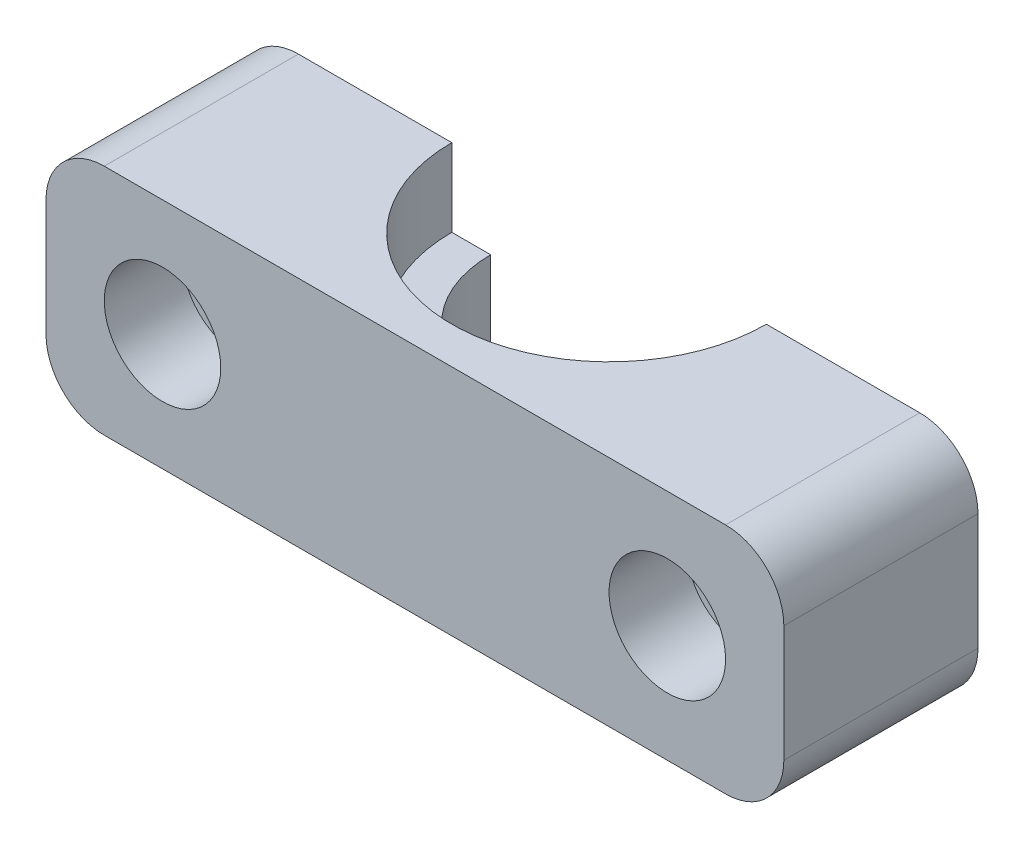
ISO-10303-21;
HEADER;
FILE_DESCRIPTION(('STEP AP214'),'2;1');
FILE_NAME('part.step','',(''),(''),'','','');
FILE_SCHEMA(('AUTOMOTIVE_DESIGN { 1 0 10303 214 1 1 1 1 }'));
ENDSEC;
DATA;
#1=APPLICATION_CONTEXT('core data for automotive mechanical design processes');
#2=APPLICATION_PROTOCOL_DEFINITION('international standard','automotive_design',2000,#1);
#3=PRODUCT_CONTEXT('',#1,'mechanical');
#4=PRODUCT('Part','Part','',(#3));
#5=PRODUCT_RELATED_PRODUCT_CATEGORY('part','',(#4));
#6=PRODUCT_DEFINITION_FORMATION('','',#4);
#7=PRODUCT_DEFINITION_CONTEXT('part definition',#1,'design');
#8=PRODUCT_DEFINITION('design','',#6,#7);
#9=PRODUCT_DEFINITION_SHAPE('','',#8);
#10=(LENGTH_UNIT() NAMED_UNIT(*) SI_UNIT(.MILLI.,.METRE.));
#11=(NAMED_UNIT(*) PLANE_ANGLE_UNIT() SI_UNIT($,.RADIAN.));
#12=(NAMED_UNIT(*) SI_UNIT($,.STERADIAN.) SOLID_ANGLE_UNIT());
#13=UNCERTAINTY_MEASURE_WITH_UNIT(LENGTH_MEASURE(1.E-05),#10,'distance_accuracy_value','');
#14=(GEOMETRIC_REPRESENTATION_CONTEXT(3) GLOBAL_UNCERTAINTY_ASSIGNED_CONTEXT((#13)) GLOBAL_UNIT_ASSIGNED_CONTEXT((#10,
#11,#12)) REPRESENTATION_CONTEXT('',''));
#15=CARTESIAN_POINT('',(0.,0.,0.));
#16=DIRECTION('',(0.,0.,1.));
#17=DIRECTION('',(1.,0.,0.));
#18=AXIS2_PLACEMENT_3D('',#15,#16,#17);
#19=CARTESIAN_POINT('',(-13.,0.,10.));
#20=DIRECTION('',(0.,0.,-1.));
#21=DIRECTION('',(-1.,0.,0.));
#22=AXIS2_PLACEMENT_3D('',#19,#20,#21);
#23=CYLINDRICAL_SURFACE('',#22,1.7);
#24=CARTESIAN_POINT('',(-13.,0.,0.));
#25=DIRECTION('',(0.,0.,1.));
#26=DIRECTION('',(1.,0.,0.));
#27=AXIS2_PLACEMENT_3D('',#24,#25,#26);
#28=CIRCLE('',#27,1.7);
#29=CARTESIAN_POINT('',(-11.3,0.,0.));
#30=VERTEX_POINT('',#29);
#31=EDGE_CURVE('E165',#30,#30,#28,.T.);
#32=ORIENTED_EDGE('',*,*,#31,.F.);
#33=EDGE_LOOP('',(#32));
#34=FACE_BOUND('',#33,.T.);
#35=CARTESIAN_POINT('',(-13.,0.,6.));
#36=DIRECTION('',(0.,0.,1.));
#37=DIRECTION('',(1.,0.,0.));
#38=AXIS2_PLACEMENT_3D('',#35,#36,#37);
#39=CIRCLE('',#38,1.7);
#40=CARTESIAN_POINT('',(-11.3,0.,6.));
#41=VERTEX_POINT('',#40);
#42=EDGE_CURVE('E38',#41,#41,#39,.T.);
#43=ORIENTED_EDGE('',*,*,#42,.T.);
#44=EDGE_LOOP('',(#43));
#45=FACE_BOUND('',#44,.T.);
#46=ADVANCED_FACE('F34',(#34,#45),#23,.F.);
#47=CARTESIAN_POINT('',(13.,0.,10.));
#48=DIRECTION('',(0.,0.,-1.));
#49=DIRECTION('',(-1.,0.,0.));
#50=AXIS2_PLACEMENT_3D('',#47,#48,#49);
#51=CYLINDRICAL_SURFACE('',#50,1.7);
#52=CARTESIAN_POINT('',(13.,0.,0.));
#53=DIRECTION('',(0.,0.,1.));
#54=DIRECTION('',(1.,0.,0.));
#55=AXIS2_PLACEMENT_3D('',#52,#53,#54);
#56=CIRCLE('',#55,1.7);
#57=CARTESIAN_POINT('',(14.7,0.,0.));
#58=VERTEX_POINT('',#57);
#59=EDGE_CURVE('E170',#58,#58,#56,.T.);
#60=ORIENTED_EDGE('',*,*,#59,.F.);
#61=EDGE_LOOP('',(#60));
#62=FACE_BOUND('',#61,.T.);
#63=CARTESIAN_POINT('',(13.,0.,6.));
#64=DIRECTION('',(0.,0.,1.));
#65=DIRECTION('',(1.,0.,0.));
#66=AXIS2_PLACEMENT_3D('',#63,#64,#65);
#67=CIRCLE('',#66,1.7);
#68=CARTESIAN_POINT('',(14.7,0.,6.));
#69=VERTEX_POINT('',#68);
#70=EDGE_CURVE('E231',#69,#69,#67,.T.);
#71=ORIENTED_EDGE('',*,*,#70,.T.);
#72=EDGE_LOOP('',(#71));
#73=FACE_BOUND('',#72,.T.);
#74=ADVANCED_FACE('F272',(#62,#73),#51,.F.);
#75=CARTESIAN_POINT('',(0.,0.,0.));
#76=DIRECTION('',(0.,0.,1.));
#77=DIRECTION('',(1.,0.,0.));
#78=AXIS2_PLACEMENT_3D('',#75,#76,#77);
#79=PLANE('',#78);
#80=ORIENTED_EDGE('',*,*,#59,.T.);
#81=EDGE_LOOP('',(#80));
#82=FACE_BOUND('',#81,.T.);
#83=DIRECTION('',(1.,0.,0.));
#84=VECTOR('',#83,1.);
#85=CARTESIAN_POINT('',(0.,-6.,0.));
#86=LINE('',#85,#84);
#87=CARTESIAN_POINT('',(8.1,-6.,0.));
#88=VERTEX_POINT('',#87);
#89=CARTESIAN_POINT('',(16.,-6.,0.));
#90=VERTEX_POINT('',#89);
#91=EDGE_CURVE('E159',#88,#90,#86,.T.);
#92=ORIENTED_EDGE('',*,*,#91,.F.);
#93=DIRECTION('',(0.,1.,0.));
#94=VECTOR('',#93,1.);
#95=CARTESIAN_POINT('',(8.1,-7.,0.));
#96=LINE('',#95,#94);
#97=CARTESIAN_POINT('',(8.1,-3.,0.));
#98=VERTEX_POINT('',#97);
#99=EDGE_CURVE('E11',#88,#98,#96,.T.);
#100=ORIENTED_EDGE('',*,*,#99,.T.);
#101=DIRECTION('',(-1.,0.,0.));
#102=VECTOR('',#101,1.);
#103=CARTESIAN_POINT('',(0.,-3.,0.));
#104=LINE('',#103,#102);
#105=CARTESIAN_POINT('',(6.1,-3.,0.));
#106=VERTEX_POINT('',#105);
#107=EDGE_CURVE('E139',#98,#106,#104,.T.);
#108=ORIENTED_EDGE('',*,*,#107,.T.);
#109=DIRECTION('',(0.,1.,0.));
#110=VECTOR('',#109,1.);
#111=CARTESIAN_POINT('',(6.1,-3.,0.));
#112=LINE('',#111,#110);
#113=CARTESIAN_POINT('',(6.1,2.,0.));
#114=VERTEX_POINT('',#113);
#115=EDGE_CURVE('E254',#106,#114,#112,.T.);
#116=ORIENTED_EDGE('',*,*,#115,.T.);
#117=DIRECTION('',(-1.,0.,0.));
#118=VECTOR('',#117,1.);
#119=CARTESIAN_POINT('',(0.,2.,0.));
#120=LINE('',#119,#118);
#121=CARTESIAN_POINT('',(8.1,2.,0.));
#122=VERTEX_POINT('',#121);
#123=EDGE_CURVE('E221',#122,#114,#120,.T.);
#124=ORIENTED_EDGE('',*,*,#123,.F.);
#125=DIRECTION('',(0.,1.,0.));
#126=VECTOR('',#125,1.);
#127=CARTESIAN_POINT('',(8.1,2.,0.));
#128=LINE('',#127,#126);
#129=CARTESIAN_POINT('',(8.1,6.,0.));
#130=VERTEX_POINT('',#129);
#131=EDGE_CURVE('E226',#122,#130,#128,.T.);
#132=ORIENTED_EDGE('',*,*,#131,.T.);
#133=DIRECTION('',(1.,0.,0.));
#134=VECTOR('',#133,1.);
#135=CARTESIAN_POINT('',(0.,6.,0.));
#136=LINE('',#135,#134);
#137=CARTESIAN_POINT('',(16.,6.,0.));
#138=VERTEX_POINT('',#137);
#139=EDGE_CURVE('E176',#130,#138,#136,.T.);
#140=ORIENTED_EDGE('',*,*,#139,.T.);
#141=CARTESIAN_POINT('',(16.,3.,0.));
#142=DIRECTION('',(0.,0.,1.));
#143=DIRECTION('',(1.,0.,0.));
#144=AXIS2_PLACEMENT_3D('',#141,#142,#143);
#145=CIRCLE('',#144,3.);
#146=CARTESIAN_POINT('',(19.,3.,0.));
#147=VERTEX_POINT('',#146);
#148=EDGE_CURVE('E190',#138,#147,#145,.F.);
#149=ORIENTED_EDGE('',*,*,#148,.T.);
#150=DIRECTION('',(0.,1.,0.));
#151=VECTOR('',#150,1.);
#152=CARTESIAN_POINT('',(19.,0.,0.));
#153=LINE('',#152,#151);
#154=CARTESIAN_POINT('',(19.,-3.,0.));
#155=VERTEX_POINT('',#154);
#156=EDGE_CURVE('E168',#155,#147,#153,.T.);
#157=ORIENTED_EDGE('',*,*,#156,.F.);
#158=CARTESIAN_POINT('',(16.,-3.,0.));
#159=DIRECTION('',(0.,0.,1.));
#160=DIRECTION('',(1.,0.,0.));
#161=AXIS2_PLACEMENT_3D('',#158,#159,#160);
#162=CIRCLE('',#161,3.);
#163=EDGE_CURVE('E161',#155,#90,#162,.F.);
#164=ORIENTED_EDGE('',*,*,#163,.T.);
#165=EDGE_LOOP('',(#92,#100,#108,#116,#124,#132,#140,#149,#157,#164));
#166=FACE_BOUND('',#165,.T.);
#167=ADVANCED_FACE('F157',(#82,#166),#79,.F.);
#168=CARTESIAN_POINT('',(0.,-6.,10.));
#169=DIRECTION('',(0.,1.,0.));
#170=DIRECTION('',(0.,0.,1.));
#171=AXIS2_PLACEMENT_3D('',#168,#169,#170);
#172=PLANE('',#171);
#173=CARTESIAN_POINT('',(-16.,-6.,0.));
#174=VERTEX_POINT('',#173);
#175=CARTESIAN_POINT('',(-8.1,-6.,0.));
#176=VERTEX_POINT('',#175);
#177=EDGE_CURVE('E164',#174,#176,#86,.T.);
#178=ORIENTED_EDGE('',*,*,#177,.T.);
#179=CARTESIAN_POINT('',(0.,-6.,0.));
#180=DIRECTION('',(0.,1.,0.));
#181=DIRECTION('',(0.,0.,1.));
#182=AXIS2_PLACEMENT_3D('',#179,#180,#181);
#183=CIRCLE('',#182,8.1);
#184=EDGE_CURVE('E148',#176,#88,#183,.T.);
#185=ORIENTED_EDGE('',*,*,#184,.T.);
#186=ORIENTED_EDGE('',*,*,#91,.T.);
#187=DIRECTION('',(0.,0.,-1.));
#188=VECTOR('',#187,1.);
#189=CARTESIAN_POINT('',(16.,-6.,10.));
#190=LINE('',#189,#188);
#191=CARTESIAN_POINT('',(16.,-6.,10.));
#192=VERTEX_POINT('',#191);
#193=EDGE_CURVE('E184',#90,#192,#190,.F.);
#194=ORIENTED_EDGE('',*,*,#193,.T.);
#195=DIRECTION('',(1.,0.,0.));
#196=VECTOR('',#195,1.);
#197=CARTESIAN_POINT('',(0.,-6.,10.));
#198=LINE('',#197,#196);
#199=CARTESIAN_POINT('',(-16.,-6.,10.));
#200=VERTEX_POINT('',#199);
#201=EDGE_CURVE('E183',#200,#192,#198,.T.);
#202=ORIENTED_EDGE('',*,*,#201,.F.);
#203=DIRECTION('',(0.,0.,-1.));
#204=VECTOR('',#203,1.);
#205=CARTESIAN_POINT('',(-16.,-6.,0.));
#206=LINE('',#205,#204);
#207=EDGE_CURVE('E186',#200,#174,#206,.T.);
#208=ORIENTED_EDGE('',*,*,#207,.T.);
#209=EDGE_LOOP('',(#178,#185,#186,#194,#202,#208));
#210=FACE_BOUND('',#209,.T.);
#211=ADVANCED_FACE('F279',(#210),#172,.F.);
#212=CARTESIAN_POINT('',(19.,0.,10.));
#213=DIRECTION('',(-1.,0.,0.));
#214=DIRECTION('',(0.,0.,1.));
#215=AXIS2_PLACEMENT_3D('',#212,#213,#214);
#216=PLANE('',#215);
#217=DIRECTION('',(0.,1.,0.));
#218=VECTOR('',#217,1.);
#219=CARTESIAN_POINT('',(19.,0.,10.));
#220=LINE('',#219,#218);
#221=CARTESIAN_POINT('',(19.,-3.,10.));
#222=VERTEX_POINT('',#221);
#223=CARTESIAN_POINT('',(19.,3.,10.));
#224=VERTEX_POINT('',#223);
#225=EDGE_CURVE('E261',#222,#224,#220,.T.);
#226=ORIENTED_EDGE('',*,*,#225,.F.);
#227=DIRECTION('',(0.,0.,-1.));
#228=VECTOR('',#227,1.);
#229=CARTESIAN_POINT('',(19.,-3.,10.));
#230=LINE('',#229,#228);
#231=EDGE_CURVE('E217',#222,#155,#230,.T.);
#232=ORIENTED_EDGE('',*,*,#231,.T.);
#233=ORIENTED_EDGE('',*,*,#156,.T.);
#234=DIRECTION('',(0.,0.,-1.));
#235=VECTOR('',#234,1.);
#236=CARTESIAN_POINT('',(19.,3.,10.));
#237=LINE('',#236,#235);
#238=EDGE_CURVE('E215',#147,#224,#237,.F.);
#239=ORIENTED_EDGE('',*,*,#238,.T.);
#240=EDGE_LOOP('',(#226,#232,#233,#239));
#241=FACE_BOUND('',#240,.T.);
#242=ADVANCED_FACE('F310',(#241),#216,.F.);
#243=CARTESIAN_POINT('',(0.,6.,10.));
#244=DIRECTION('',(0.,1.,0.));
#245=DIRECTION('',(0.,0.,1.));
#246=AXIS2_PLACEMENT_3D('',#243,#244,#245);
#247=PLANE('',#246);
#248=CARTESIAN_POINT('',(0.,6.,0.));
#249=DIRECTION('',(0.,1.,0.));
#250=DIRECTION('',(0.,0.,1.));
#251=AXIS2_PLACEMENT_3D('',#248,#249,#250);
#252=CIRCLE('',#251,8.1);
#253=CARTESIAN_POINT('',(-8.1,6.,0.));
#254=VERTEX_POINT('',#253);
#255=EDGE_CURVE('E256',#254,#130,#252,.T.);
#256=ORIENTED_EDGE('',*,*,#255,.F.);
#257=CARTESIAN_POINT('',(-16.,6.,0.));
#258=VERTEX_POINT('',#257);
#259=EDGE_CURVE('E177',#258,#254,#136,.T.);
#260=ORIENTED_EDGE('',*,*,#259,.F.);
#261=DIRECTION('',(0.,0.,-1.));
#262=VECTOR('',#261,1.);
#263=CARTESIAN_POINT('',(-16.,6.,10.));
#264=LINE('',#263,#262);
#265=CARTESIAN_POINT('',(-16.,6.,10.));
#266=VERTEX_POINT('',#265);
#267=EDGE_CURVE('E213',#258,#266,#264,.F.);
#268=ORIENTED_EDGE('',*,*,#267,.T.);
#269=DIRECTION('',(1.,0.,0.));
#270=VECTOR('',#269,1.);
#271=CARTESIAN_POINT('',(0.,6.,10.));
#272=LINE('',#271,#270);
#273=CARTESIAN_POINT('',(16.,6.,10.));
#274=VERTEX_POINT('',#273);
#275=EDGE_CURVE('E264',#266,#274,#272,.T.);
#276=ORIENTED_EDGE('',*,*,#275,.T.);
#277=DIRECTION('',(0.,0.,-1.));
#278=VECTOR('',#277,1.);
#279=CARTESIAN_POINT('',(16.,6.,0.));
#280=LINE('',#279,#278);
#281=EDGE_CURVE('E210',#274,#138,#280,.T.);
#282=ORIENTED_EDGE('',*,*,#281,.T.);
#283=ORIENTED_EDGE('',*,*,#139,.F.);
#284=EDGE_LOOP('',(#256,#260,#268,#276,#282,#283));
#285=FACE_BOUND('',#284,.T.);
#286=ADVANCED_FACE('F318',(#285),#247,.T.);
#287=CARTESIAN_POINT('',(-19.,0.,10.));
#288=DIRECTION('',(-1.,0.,0.));
#289=DIRECTION('',(0.,0.,1.));
#290=AXIS2_PLACEMENT_3D('',#287,#288,#289);
#291=PLANE('',#290);
#292=DIRECTION('',(0.,1.,0.));
#293=VECTOR('',#292,1.);
#294=CARTESIAN_POINT('',(-19.,0.,0.));
#295=LINE('',#294,#293);
#296=CARTESIAN_POINT('',(-19.,-3.,0.));
#297=VERTEX_POINT('',#296);
#298=CARTESIAN_POINT('',(-19.,3.,0.));
#299=VERTEX_POINT('',#298);
#300=EDGE_CURVE('E180',#297,#299,#295,.T.);
#301=ORIENTED_EDGE('',*,*,#300,.F.);
#302=DIRECTION('',(0.,0.,-1.));
#303=VECTOR('',#302,1.);
#304=CARTESIAN_POINT('',(-19.,-3.,10.));
#305=LINE('',#304,#303);
#306=CARTESIAN_POINT('',(-19.,-3.,10.));
#307=VERTEX_POINT('',#306);
#308=EDGE_CURVE('E200',#297,#307,#305,.F.);
#309=ORIENTED_EDGE('',*,*,#308,.T.);
#310=DIRECTION('',(0.,1.,0.));
#311=VECTOR('',#310,1.);
#312=CARTESIAN_POINT('',(-19.,0.,10.));
#313=LINE('',#312,#311);
#314=CARTESIAN_POINT('',(-19.,3.,10.));
#315=VERTEX_POINT('',#314);
#316=EDGE_CURVE('E187',#307,#315,#313,.T.);
#317=ORIENTED_EDGE('',*,*,#316,.T.);
#318=DIRECTION('',(0.,0.,-1.));
#319=VECTOR('',#318,1.);
#320=CARTESIAN_POINT('',(-19.,3.,10.));
#321=LINE('',#320,#319);
#322=EDGE_CURVE('E197',#315,#299,#321,.T.);
#323=ORIENTED_EDGE('',*,*,#322,.T.);
#324=EDGE_LOOP('',(#301,#309,#317,#323));
#325=FACE_BOUND('',#324,.T.);
#326=ADVANCED_FACE('F326',(#325),#291,.T.);
#327=CARTESIAN_POINT('',(0.,0.,10.));
#328=DIRECTION('',(0.,0.,1.));
#329=DIRECTION('',(1.,0.,0.));
#330=AXIS2_PLACEMENT_3D('',#327,#328,#329);
#331=PLANE('',#330);
#332=CARTESIAN_POINT('',(-13.,0.,10.));
#333=DIRECTION('',(0.,0.,1.));
#334=DIRECTION('',(1.,0.,0.));
#335=AXIS2_PLACEMENT_3D('',#332,#333,#334);
#336=CIRCLE('',#335,3.);
#337=CARTESIAN_POINT('',(-10.,0.,10.));
#338=VERTEX_POINT('',#337);
#339=EDGE_CURVE('E238',#338,#338,#336,.T.);
#340=ORIENTED_EDGE('',*,*,#339,.F.);
#341=EDGE_LOOP('',(#340));
#342=FACE_BOUND('',#341,.T.);
#343=CARTESIAN_POINT('',(13.,0.,10.));
#344=DIRECTION('',(0.,0.,1.));
#345=DIRECTION('',(1.,0.,0.));
#346=AXIS2_PLACEMENT_3D('',#343,#344,#345);
#347=CIRCLE('',#346,3.);
#348=CARTESIAN_POINT('',(16.,0.,10.));
#349=VERTEX_POINT('',#348);
#350=EDGE_CURVE('E248',#349,#349,#347,.T.);
#351=ORIENTED_EDGE('',*,*,#350,.F.);
#352=EDGE_LOOP('',(#351));
#353=FACE_BOUND('',#352,.T.);
#354=ORIENTED_EDGE('',*,*,#316,.F.);
#355=CARTESIAN_POINT('',(-16.,-3.,10.));
#356=DIRECTION('',(0.,0.,1.));
#357=DIRECTION('',(1.,0.,0.));
#358=AXIS2_PLACEMENT_3D('',#355,#356,#357);
#359=CIRCLE('',#358,3.);
#360=EDGE_CURVE('E208',#307,#200,#359,.T.);
#361=ORIENTED_EDGE('',*,*,#360,.T.);
#362=ORIENTED_EDGE('',*,*,#201,.T.);
#363=CARTESIAN_POINT('',(16.,-3.,10.));
#364=DIRECTION('',(0.,0.,1.));
#365=DIRECTION('',(1.,0.,0.));
#366=AXIS2_PLACEMENT_3D('',#363,#364,#365);
#367=CIRCLE('',#366,3.);
#368=EDGE_CURVE('E204',#192,#222,#367,.T.);
#369=ORIENTED_EDGE('',*,*,#368,.T.);
#370=ORIENTED_EDGE('',*,*,#225,.T.);
#371=CARTESIAN_POINT('',(16.,3.,10.));
#372=DIRECTION('',(0.,0.,1.));
#373=DIRECTION('',(1.,0.,0.));
#374=AXIS2_PLACEMENT_3D('',#371,#372,#373);
#375=CIRCLE('',#374,3.);
#376=EDGE_CURVE('E202',#224,#274,#375,.T.);
#377=ORIENTED_EDGE('',*,*,#376,.T.);
#378=ORIENTED_EDGE('',*,*,#275,.F.);
#379=CARTESIAN_POINT('',(-16.,3.,10.));
#380=DIRECTION('',(0.,0.,1.));
#381=DIRECTION('',(1.,0.,0.));
#382=AXIS2_PLACEMENT_3D('',#379,#380,#381);
#383=CIRCLE('',#382,3.);
#384=EDGE_CURVE('E206',#266,#315,#383,.T.);
#385=ORIENTED_EDGE('',*,*,#384,.T.);
#386=EDGE_LOOP('',(#354,#361,#362,#369,#370,#377,#378,#385));
#387=FACE_BOUND('',#386,.T.);
#388=ADVANCED_FACE('F306',(#342,#353,#387),#331,.T.);
#389=ORIENTED_EDGE('',*,*,#31,.T.);
#390=EDGE_LOOP('',(#389));
#391=FACE_BOUND('',#390,.T.);
#392=CARTESIAN_POINT('',(-6.1,-3.,0.));
#393=VERTEX_POINT('',#392);
#394=CARTESIAN_POINT('',(-8.1,-3.,0.));
#395=VERTEX_POINT('',#394);
#396=EDGE_CURVE('E149',#393,#395,#104,.T.);
#397=ORIENTED_EDGE('',*,*,#396,.T.);
#398=DIRECTION('',(0.,1.,0.));
#399=VECTOR('',#398,1.);
#400=CARTESIAN_POINT('',(-8.1,-7.,0.));
#401=LINE('',#400,#399);
#402=EDGE_CURVE('E43',#395,#176,#401,.F.);
#403=ORIENTED_EDGE('',*,*,#402,.T.);
#404=ORIENTED_EDGE('',*,*,#177,.F.);
#405=CARTESIAN_POINT('',(-16.,-3.,0.));
#406=DIRECTION('',(0.,0.,1.));
#407=DIRECTION('',(1.,0.,0.));
#408=AXIS2_PLACEMENT_3D('',#405,#406,#407);
#409=CIRCLE('',#408,3.);
#410=EDGE_CURVE('E195',#174,#297,#409,.F.);
#411=ORIENTED_EDGE('',*,*,#410,.T.);
#412=ORIENTED_EDGE('',*,*,#300,.T.);
#413=CARTESIAN_POINT('',(-16.,3.,0.));
#414=DIRECTION('',(0.,0.,1.));
#415=DIRECTION('',(1.,0.,0.));
#416=AXIS2_PLACEMENT_3D('',#413,#414,#415);
#417=CIRCLE('',#416,3.);
#418=EDGE_CURVE('E193',#299,#258,#417,.F.);
#419=ORIENTED_EDGE('',*,*,#418,.T.);
#420=ORIENTED_EDGE('',*,*,#259,.T.);
#421=DIRECTION('',(0.,1.,0.));
#422=VECTOR('',#421,1.);
#423=CARTESIAN_POINT('',(-8.1,2.,0.));
#424=LINE('',#423,#422);
#425=CARTESIAN_POINT('',(-8.1,2.,0.));
#426=VERTEX_POINT('',#425);
#427=EDGE_CURVE('E223',#254,#426,#424,.F.);
#428=ORIENTED_EDGE('',*,*,#427,.T.);
#429=CARTESIAN_POINT('',(-6.1,2.,0.));
#430=VERTEX_POINT('',#429);
#431=EDGE_CURVE('E220',#430,#426,#120,.T.);
#432=ORIENTED_EDGE('',*,*,#431,.F.);
#433=DIRECTION('',(0.,1.,0.));
#434=VECTOR('',#433,1.);
#435=CARTESIAN_POINT('',(-6.1,-3.,0.));
#436=LINE('',#435,#434);
#437=EDGE_CURVE('E51',#430,#393,#436,.F.);
#438=ORIENTED_EDGE('',*,*,#437,.T.);
#439=EDGE_LOOP('',(#397,#403,#404,#411,#412,#419,#420,#428,#432,#438));
#440=FACE_BOUND('',#439,.T.);
#441=ADVANCED_FACE('F281',(#391,#440),#79,.F.);
#442=CARTESIAN_POINT('',(-16.,-3.,10.));
#443=DIRECTION('',(0.,0.,1.));
#444=DIRECTION('',(1.,0.,0.));
#445=AXIS2_PLACEMENT_3D('',#442,#443,#444);
#446=CYLINDRICAL_SURFACE('',#445,3.);
#447=ORIENTED_EDGE('',*,*,#360,.F.);
#448=ORIENTED_EDGE('',*,*,#308,.F.);
#449=ORIENTED_EDGE('',*,*,#410,.F.);
#450=ORIENTED_EDGE('',*,*,#207,.F.);
#451=EDGE_LOOP('',(#447,#448,#449,#450));
#452=FACE_BOUND('',#451,.T.);
#453=ADVANCED_FACE('F286',(#452),#446,.T.);
#454=CARTESIAN_POINT('',(-16.,3.,10.));
#455=DIRECTION('',(0.,0.,-1.));
#456=DIRECTION('',(-1.,0.,0.));
#457=AXIS2_PLACEMENT_3D('',#454,#455,#456);
#458=CYLINDRICAL_SURFACE('',#457,3.);
#459=ORIENTED_EDGE('',*,*,#384,.F.);
#460=ORIENTED_EDGE('',*,*,#267,.F.);
#461=ORIENTED_EDGE('',*,*,#418,.F.);
#462=ORIENTED_EDGE('',*,*,#322,.F.);
#463=EDGE_LOOP('',(#459,#460,#461,#462));
#464=FACE_BOUND('',#463,.T.);
#465=ADVANCED_FACE('F289',(#464),#458,.T.);
#466=CARTESIAN_POINT('',(16.,-3.,10.));
#467=DIRECTION('',(0.,0.,-1.));
#468=DIRECTION('',(-1.,0.,0.));
#469=AXIS2_PLACEMENT_3D('',#466,#467,#468);
#470=CYLINDRICAL_SURFACE('',#469,3.);
#471=ORIENTED_EDGE('',*,*,#368,.F.);
#472=ORIENTED_EDGE('',*,*,#193,.F.);
#473=ORIENTED_EDGE('',*,*,#163,.F.);
#474=ORIENTED_EDGE('',*,*,#231,.F.);
#475=EDGE_LOOP('',(#471,#472,#473,#474));
#476=FACE_BOUND('',#475,.T.);
#477=ADVANCED_FACE('F292',(#476),#470,.T.);
#478=CARTESIAN_POINT('',(16.,3.,10.));
#479=DIRECTION('',(0.,0.,1.));
#480=DIRECTION('',(1.,0.,0.));
#481=AXIS2_PLACEMENT_3D('',#478,#479,#480);
#482=CYLINDRICAL_SURFACE('',#481,3.);
#483=ORIENTED_EDGE('',*,*,#376,.F.);
#484=ORIENTED_EDGE('',*,*,#238,.F.);
#485=ORIENTED_EDGE('',*,*,#148,.F.);
#486=ORIENTED_EDGE('',*,*,#281,.F.);
#487=EDGE_LOOP('',(#483,#484,#485,#486));
#488=FACE_BOUND('',#487,.T.);
#489=ADVANCED_FACE('F36',(#488),#482,.T.);
#490=CARTESIAN_POINT('',(0.,2.,0.));
#491=DIRECTION('',(0.,1.,0.));
#492=DIRECTION('',(0.,0.,1.));
#493=AXIS2_PLACEMENT_3D('',#490,#491,#492);
#494=CYLINDRICAL_SURFACE('',#493,8.1);
#495=CARTESIAN_POINT('',(0.,2.,0.));
#496=DIRECTION('',(0.,1.,0.));
#497=DIRECTION('',(0.,0.,1.));
#498=AXIS2_PLACEMENT_3D('',#495,#496,#497);
#499=CIRCLE('',#498,8.1);
#500=EDGE_CURVE('E59',#426,#122,#499,.T.);
#501=ORIENTED_EDGE('',*,*,#500,.F.);
#502=ORIENTED_EDGE('',*,*,#427,.F.);
#503=ORIENTED_EDGE('',*,*,#255,.T.);
#504=ORIENTED_EDGE('',*,*,#131,.F.);
#505=EDGE_LOOP('',(#501,#502,#503,#504));
#506=FACE_BOUND('',#505,.T.);
#507=ADVANCED_FACE('F299',(#506),#494,.F.);
#508=CARTESIAN_POINT('',(0.,2.,0.));
#509=DIRECTION('',(0.,1.,0.));
#510=DIRECTION('',(0.,0.,1.));
#511=AXIS2_PLACEMENT_3D('',#508,#509,#510);
#512=PLANE('',#511);
#513=CARTESIAN_POINT('',(0.,2.,0.));
#514=DIRECTION('',(0.,1.,0.));
#515=DIRECTION('',(0.,0.,1.));
#516=AXIS2_PLACEMENT_3D('',#513,#514,#515);
#517=CIRCLE('',#516,6.1);
#518=EDGE_CURVE('E229',#430,#114,#517,.T.);
#519=ORIENTED_EDGE('',*,*,#518,.F.);
#520=ORIENTED_EDGE('',*,*,#431,.T.);
#521=ORIENTED_EDGE('',*,*,#500,.T.);
#522=ORIENTED_EDGE('',*,*,#123,.T.);
#523=EDGE_LOOP('',(#519,#520,#521,#522));
#524=FACE_BOUND('',#523,.T.);
#525=ADVANCED_FACE('F334',(#524),#512,.T.);
#526=CARTESIAN_POINT('',(0.,-3.,0.));
#527=DIRECTION('',(0.,1.,0.));
#528=DIRECTION('',(0.,0.,1.));
#529=AXIS2_PLACEMENT_3D('',#526,#527,#528);
#530=CYLINDRICAL_SURFACE('',#529,6.1);
#531=CARTESIAN_POINT('',(0.,-3.,0.));
#532=DIRECTION('',(0.,1.,0.));
#533=DIRECTION('',(0.,0.,1.));
#534=AXIS2_PLACEMENT_3D('',#531,#532,#533);
#535=CIRCLE('',#534,6.1);
#536=EDGE_CURVE('E144',#393,#106,#535,.T.);
#537=ORIENTED_EDGE('',*,*,#536,.F.);
#538=ORIENTED_EDGE('',*,*,#437,.F.);
#539=ORIENTED_EDGE('',*,*,#518,.T.);
#540=ORIENTED_EDGE('',*,*,#115,.F.);
#541=EDGE_LOOP('',(#537,#538,#539,#540));
#542=FACE_BOUND('',#541,.T.);
#543=ADVANCED_FACE('F332',(#542),#530,.F.);
#544=CARTESIAN_POINT('',(0.,-7.,0.));
#545=DIRECTION('',(0.,1.,0.));
#546=DIRECTION('',(0.,0.,1.));
#547=AXIS2_PLACEMENT_3D('',#544,#545,#546);
#548=CYLINDRICAL_SURFACE('',#547,8.1);
#549=ORIENTED_EDGE('',*,*,#184,.F.);
#550=ORIENTED_EDGE('',*,*,#402,.F.);
#551=CARTESIAN_POINT('',(0.,-3.,0.));
#552=DIRECTION('',(0.,1.,0.));
#553=DIRECTION('',(0.,0.,1.));
#554=AXIS2_PLACEMENT_3D('',#551,#552,#553);
#555=CIRCLE('',#554,8.1);
#556=EDGE_CURVE('E142',#395,#98,#555,.T.);
#557=ORIENTED_EDGE('',*,*,#556,.T.);
#558=ORIENTED_EDGE('',*,*,#99,.F.);
#559=EDGE_LOOP('',(#549,#550,#557,#558));
#560=FACE_BOUND('',#559,.T.);
#561=ADVANCED_FACE('F152',(#560),#548,.F.);
#562=CARTESIAN_POINT('',(0.,-3.,0.));
#563=DIRECTION('',(0.,1.,0.));
#564=DIRECTION('',(0.,0.,1.));
#565=AXIS2_PLACEMENT_3D('',#562,#563,#564);
#566=PLANE('',#565);
#567=ORIENTED_EDGE('',*,*,#556,.F.);
#568=ORIENTED_EDGE('',*,*,#396,.F.);
#569=ORIENTED_EDGE('',*,*,#536,.T.);
#570=ORIENTED_EDGE('',*,*,#107,.F.);
#571=EDGE_LOOP('',(#567,#568,#569,#570));
#572=FACE_BOUND('',#571,.T.);
#573=ADVANCED_FACE('F141',(#572),#566,.F.);
#574=CARTESIAN_POINT('',(13.,0.,6.));
#575=DIRECTION('',(0.,0.,1.));
#576=DIRECTION('',(1.,0.,0.));
#577=AXIS2_PLACEMENT_3D('',#574,#575,#576);
#578=CYLINDRICAL_SURFACE('',#577,3.);
#579=CARTESIAN_POINT('',(13.,0.,6.));
#580=DIRECTION('',(0.,0.,1.));
#581=DIRECTION('',(1.,0.,0.));
#582=AXIS2_PLACEMENT_3D('',#579,#580,#581);
#583=CIRCLE('',#582,3.);
#584=CARTESIAN_POINT('',(16.,0.,6.));
#585=VERTEX_POINT('',#584);
#586=EDGE_CURVE('E243',#585,#585,#583,.T.);
#587=ORIENTED_EDGE('',*,*,#586,.F.);
#588=EDGE_LOOP('',(#587));
#589=FACE_BOUND('',#588,.T.);
#590=ORIENTED_EDGE('',*,*,#350,.T.);
#591=EDGE_LOOP('',(#590));
#592=FACE_BOUND('',#591,.T.);
#593=ADVANCED_FACE('F434',(#589,#592),#578,.F.);
#594=CARTESIAN_POINT('',(13.,0.,6.));
#595=DIRECTION('',(0.,0.,1.));
#596=DIRECTION('',(1.,0.,0.));
#597=AXIS2_PLACEMENT_3D('',#594,#595,#596);
#598=PLANE('',#597);
#599=ORIENTED_EDGE('',*,*,#70,.F.);
#600=EDGE_LOOP('',(#599));
#601=FACE_BOUND('',#600,.T.);
#602=ORIENTED_EDGE('',*,*,#586,.T.);
#603=EDGE_LOOP('',(#602));
#604=FACE_BOUND('',#603,.T.);
#605=ADVANCED_FACE('F450',(#601,#604),#598,.T.);
#606=CARTESIAN_POINT('',(-13.,0.,6.));
#607=DIRECTION('',(0.,0.,1.));
#608=DIRECTION('',(1.,0.,0.));
#609=AXIS2_PLACEMENT_3D('',#606,#607,#608);
#610=CYLINDRICAL_SURFACE('',#609,3.);
#611=CARTESIAN_POINT('',(-13.,0.,6.));
#612=DIRECTION('',(0.,0.,1.));
#613=DIRECTION('',(1.,0.,0.));
#614=AXIS2_PLACEMENT_3D('',#611,#612,#613);
#615=CIRCLE('',#614,3.);
#616=CARTESIAN_POINT('',(-10.,0.,6.));
#617=VERTEX_POINT('',#616);
#618=EDGE_CURVE('E233',#617,#617,#615,.T.);
#619=ORIENTED_EDGE('',*,*,#618,.F.);
#620=EDGE_LOOP('',(#619));
#621=FACE_BOUND('',#620,.T.);
#622=ORIENTED_EDGE('',*,*,#339,.T.);
#623=EDGE_LOOP('',(#622));
#624=FACE_BOUND('',#623,.T.);
#625=ADVANCED_FACE('F459',(#621,#624),#610,.F.);
#626=CARTESIAN_POINT('',(-13.,0.,6.));
#627=DIRECTION('',(0.,0.,1.));
#628=DIRECTION('',(1.,0.,0.));
#629=AXIS2_PLACEMENT_3D('',#626,#627,#628);
#630=PLANE('',#629);
#631=ORIENTED_EDGE('',*,*,#42,.F.);
#632=EDGE_LOOP('',(#631));
#633=FACE_BOUND('',#632,.T.);
#634=ORIENTED_EDGE('',*,*,#618,.T.);
#635=EDGE_LOOP('',(#634));
#636=FACE_BOUND('',#635,.T.);
#637=ADVANCED_FACE('F468',(#633,#636),#630,.T.);
#638=CLOSED_SHELL('',(#46,#74,#167,#211,#242,#286,#326,#388,#441,#453,#465,#477,#489,#507,#525,
#543,#561,#573,#593,#605,#625,#637));
#639=MANIFOLD_SOLID_BREP('B2',#638);
#640=ADVANCED_BREP_SHAPE_REPRESENTATION('',(#18,#639),#14);
#641=SHAPE_DEFINITION_REPRESENTATION(#9,#640);
ENDSEC;
END-ISO-10303-21;
